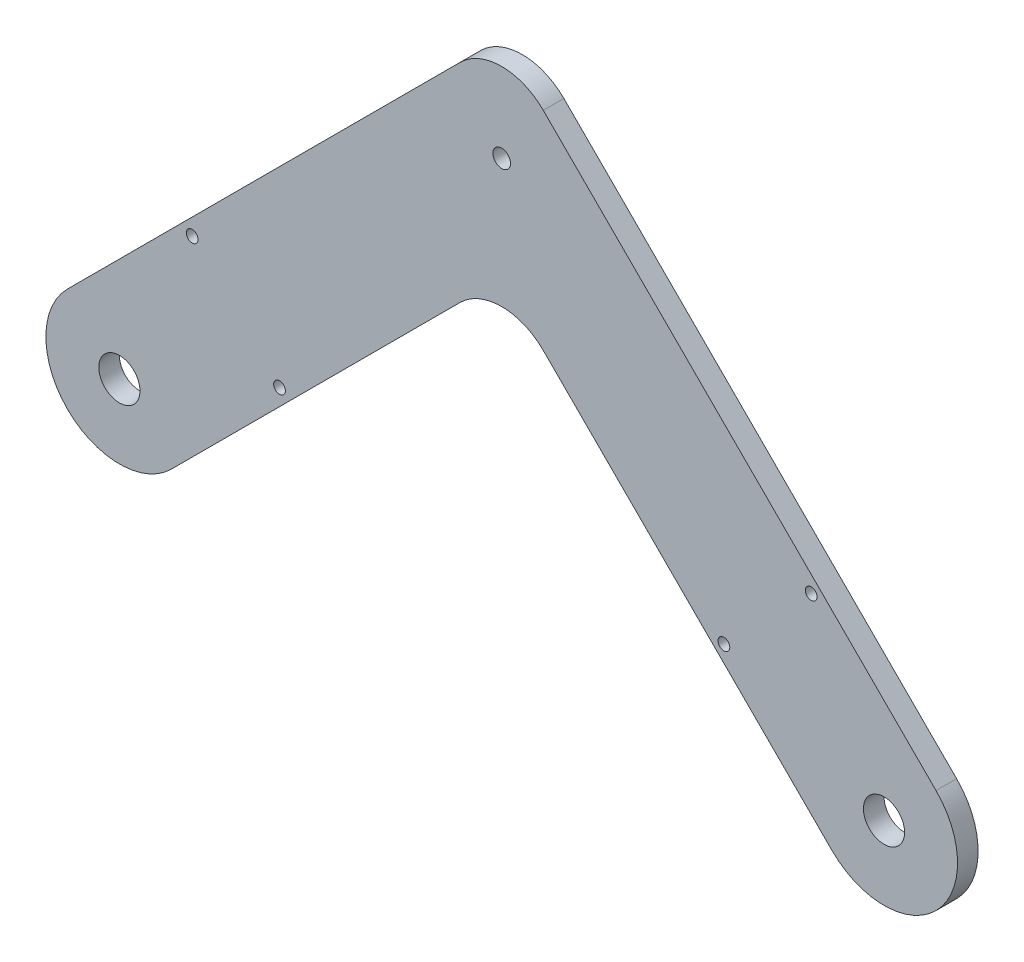
ISO-10303-21;
HEADER;
FILE_DESCRIPTION(('STEP AP214'),'2;1');
FILE_NAME('part.step','',(''),(''),'','','');
FILE_SCHEMA(('AUTOMOTIVE_DESIGN { 1 0 10303 214 1 1 1 1 }'));
ENDSEC;
DATA;
#1=APPLICATION_CONTEXT('core data for automotive mechanical design processes');
#2=APPLICATION_PROTOCOL_DEFINITION('international standard','automotive_design',2000,#1);
#3=PRODUCT_CONTEXT('',#1,'mechanical');
#4=PRODUCT('Part','Part','',(#3));
#5=PRODUCT_RELATED_PRODUCT_CATEGORY('part','',(#4));
#6=PRODUCT_DEFINITION_FORMATION('','',#4);
#7=PRODUCT_DEFINITION_CONTEXT('part definition',#1,'design');
#8=PRODUCT_DEFINITION('design','',#6,#7);
#9=PRODUCT_DEFINITION_SHAPE('','',#8);
#10=(LENGTH_UNIT() NAMED_UNIT(*) SI_UNIT(.MILLI.,.METRE.));
#11=(NAMED_UNIT(*) PLANE_ANGLE_UNIT() SI_UNIT($,.RADIAN.));
#12=(NAMED_UNIT(*) SI_UNIT($,.STERADIAN.) SOLID_ANGLE_UNIT());
#13=UNCERTAINTY_MEASURE_WITH_UNIT(LENGTH_MEASURE(1.E-05),#10,'distance_accuracy_value','');
#14=(GEOMETRIC_REPRESENTATION_CONTEXT(3) GLOBAL_UNCERTAINTY_ASSIGNED_CONTEXT((#13)) GLOBAL_UNIT_ASSIGNED_CONTEXT((#10,
#11,#12)) REPRESENTATION_CONTEXT('',''));
#15=CARTESIAN_POINT('',(0.,0.,0.));
#16=DIRECTION('',(0.,0.,1.));
#17=DIRECTION('',(1.,0.,0.));
#18=AXIS2_PLACEMENT_3D('',#15,#16,#17);
#19=CARTESIAN_POINT('',(-41.3388347648319,41.3388347648318,-3.5));
#20=DIRECTION('',(0.707106781186548,-0.707106781186548,0.));
#21=DIRECTION('',(0.707106781186547,0.707106781186548,0.));
#22=AXIS2_PLACEMENT_3D('',#19,#20,#21);
#23=PLANE('',#22);
#24=DIRECTION('',(0.707106781186547,0.707106781186548,0.));
#25=VECTOR('',#24,1.);
#26=CARTESIAN_POINT('',(-41.3388347648319,41.3388347648318,0.));
#27=LINE('',#26,#25);
#28=CARTESIAN_POINT('',(-73.8388347648318,8.83883476483185,0.));
#29=VERTEX_POINT('',#28);
#30=CARTESIAN_POINT('',(-7.07106781186494,75.6066017177988,0.));
#31=VERTEX_POINT('',#30);
#32=EDGE_CURVE('E142',#29,#31,#27,.T.);
#33=ORIENTED_EDGE('',*,*,#32,.T.);
#34=DIRECTION('',(0.,0.,1.));
#35=VECTOR('',#34,1.);
#36=CARTESIAN_POINT('',(-7.07106781186494,75.6066017177988,-3.5));
#37=LINE('',#36,#35);
#38=CARTESIAN_POINT('',(-7.07106781186494,75.6066017177988,-3.5));
#39=VERTEX_POINT('',#38);
#40=EDGE_CURVE('E53',#31,#39,#37,.F.);
#41=ORIENTED_EDGE('',*,*,#40,.T.);
#42=DIRECTION('',(0.707106781186547,0.707106781186548,0.));
#43=VECTOR('',#42,1.);
#44=CARTESIAN_POINT('',(-41.3388347648319,41.3388347648318,-3.5));
#45=LINE('',#44,#43);
#46=CARTESIAN_POINT('',(-73.8388347648318,8.83883476483185,-3.5));
#47=VERTEX_POINT('',#46);
#48=EDGE_CURVE('E113',#47,#39,#45,.T.);
#49=ORIENTED_EDGE('',*,*,#48,.F.);
#50=DIRECTION('',(0.,0.,1.));
#51=VECTOR('',#50,1.);
#52=CARTESIAN_POINT('',(-73.8388347648318,8.83883476483185,-3.5));
#53=LINE('',#52,#51);
#54=EDGE_CURVE('E104',#47,#29,#53,.T.);
#55=ORIENTED_EDGE('',*,*,#54,.T.);
#56=EDGE_LOOP('',(#33,#41,#49,#55));
#57=FACE_BOUND('',#56,.T.);
#58=ADVANCED_FACE('F38',(#57),#23,.F.);
#59=CARTESIAN_POINT('',(41.3388347648324,41.3388347648321,-3.5));
#60=DIRECTION('',(-0.70710678118655,-0.707106781186545,0.));
#61=DIRECTION('',(0.707106781186545,-0.70710678118655,0.));
#62=AXIS2_PLACEMENT_3D('',#59,#60,#61);
#63=PLANE('',#62);
#64=DIRECTION('',(0.707106781186545,-0.70710678118655,0.));
#65=VECTOR('',#64,1.);
#66=CARTESIAN_POINT('',(41.3388347648324,41.3388347648321,-3.5));
#67=LINE('',#66,#65);
#68=CARTESIAN_POINT('',(7.07106781186602,75.6066017177988,-3.5));
#69=VERTEX_POINT('',#68);
#70=CARTESIAN_POINT('',(73.8388347648326,8.83883476483167,-3.5));
#71=VERTEX_POINT('',#70);
#72=EDGE_CURVE('E111',#69,#71,#67,.T.);
#73=ORIENTED_EDGE('',*,*,#72,.F.);
#74=DIRECTION('',(0.,0.,1.));
#75=VECTOR('',#74,1.);
#76=CARTESIAN_POINT('',(7.07106781186603,75.6066017177987,-3.5));
#77=LINE('',#76,#75);
#78=CARTESIAN_POINT('',(7.07106781186602,75.6066017177988,0.));
#79=VERTEX_POINT('',#78);
#80=EDGE_CURVE('E168',#69,#79,#77,.T.);
#81=ORIENTED_EDGE('',*,*,#80,.T.);
#82=DIRECTION('',(0.707106781186545,-0.70710678118655,0.));
#83=VECTOR('',#82,1.);
#84=CARTESIAN_POINT('',(41.3388347648324,41.3388347648321,0.));
#85=LINE('',#84,#83);
#86=CARTESIAN_POINT('',(73.8388347648326,8.83883476483167,0.));
#87=VERTEX_POINT('',#86);
#88=EDGE_CURVE('E153',#79,#87,#85,.T.);
#89=ORIENTED_EDGE('',*,*,#88,.T.);
#90=DIRECTION('',(0.,0.,1.));
#91=VECTOR('',#90,1.);
#92=CARTESIAN_POINT('',(73.8388347648326,8.83883476483167,-3.5));
#93=LINE('',#92,#91);
#94=EDGE_CURVE('E156',#71,#87,#93,.T.);
#95=ORIENTED_EDGE('',*,*,#94,.F.);
#96=EDGE_LOOP('',(#73,#81,#89,#95));
#97=FACE_BOUND('',#96,.T.);
#98=ADVANCED_FACE('F195',(#97),#63,.F.);
#99=CARTESIAN_POINT('',(65.0000000000005,-2.44140223043168E-13,-3.5));
#100=DIRECTION('',(0.,0.,1.));
#101=DIRECTION('',(1.,0.,0.));
#102=AXIS2_PLACEMENT_3D('',#99,#100,#101);
#103=CYLINDRICAL_SURFACE('',#102,12.5000000000002);
#104=CARTESIAN_POINT('',(65.0000000000005,-2.44140223043168E-13,0.));
#105=DIRECTION('',(0.,0.,1.));
#106=DIRECTION('',(1.,0.,0.));
#107=AXIS2_PLACEMENT_3D('',#104,#105,#106);
#108=CIRCLE('',#107,12.5000000000002);
#109=CARTESIAN_POINT('',(56.1611652351685,-8.83883476483222,0.));
#110=VERTEX_POINT('',#109);
#111=EDGE_CURVE('E150',#110,#87,#108,.T.);
#112=ORIENTED_EDGE('',*,*,#111,.F.);
#113=DIRECTION('',(0.,0.,1.));
#114=VECTOR('',#113,1.);
#115=CARTESIAN_POINT('',(56.1611652351685,-8.83883476483222,-3.5));
#116=LINE('',#115,#114);
#117=CARTESIAN_POINT('',(56.1611652351685,-8.83883476483222,-3.5));
#118=VERTEX_POINT('',#117);
#119=EDGE_CURVE('E160',#118,#110,#116,.T.);
#120=ORIENTED_EDGE('',*,*,#119,.F.);
#121=CARTESIAN_POINT('',(65.0000000000005,-2.44140223043168E-13,-3.5));
#122=DIRECTION('',(0.,0.,1.));
#123=DIRECTION('',(1.,0.,0.));
#124=AXIS2_PLACEMENT_3D('',#121,#122,#123);
#125=CIRCLE('',#124,12.5000000000002);
#126=EDGE_CURVE('E128',#118,#71,#125,.T.);
#127=ORIENTED_EDGE('',*,*,#126,.T.);
#128=ORIENTED_EDGE('',*,*,#94,.T.);
#129=EDGE_LOOP('',(#112,#120,#127,#128));
#130=FACE_BOUND('',#129,.T.);
#131=ADVANCED_FACE('F197',(#130),#103,.T.);
#132=CARTESIAN_POINT('',(23.6611652351684,23.6611652351682,-3.5));
#133=DIRECTION('',(-0.70710678118655,-0.707106781186545,0.));
#134=DIRECTION('',(0.707106781186545,-0.70710678118655,0.));
#135=AXIS2_PLACEMENT_3D('',#132,#133,#134);
#136=PLANE('',#135);
#137=DIRECTION('',(0.707106781186545,-0.70710678118655,0.));
#138=VECTOR('',#137,1.);
#139=CARTESIAN_POINT('',(23.6611652351684,23.6611652351682,0.));
#140=LINE('',#139,#138);
#141=CARTESIAN_POINT('',(7.07106781186568,40.251262658471,0.));
#142=VERTEX_POINT('',#141);
#143=EDGE_CURVE('E148',#142,#110,#140,.T.);
#144=ORIENTED_EDGE('',*,*,#143,.F.);
#145=DIRECTION('',(0.,0.,1.));
#146=VECTOR('',#145,1.);
#147=CARTESIAN_POINT('',(7.07106781186568,40.251262658471,-3.5));
#148=LINE('',#147,#146);
#149=CARTESIAN_POINT('',(7.07106781186568,40.251262658471,-3.5));
#150=VERTEX_POINT('',#149);
#151=EDGE_CURVE('E166',#142,#150,#148,.F.);
#152=ORIENTED_EDGE('',*,*,#151,.T.);
#153=DIRECTION('',(0.707106781186545,-0.70710678118655,0.));
#154=VECTOR('',#153,1.);
#155=CARTESIAN_POINT('',(23.6611652351684,23.6611652351682,-3.5));
#156=LINE('',#155,#154);
#157=EDGE_CURVE('E123',#150,#118,#156,.T.);
#158=ORIENTED_EDGE('',*,*,#157,.T.);
#159=ORIENTED_EDGE('',*,*,#119,.T.);
#160=EDGE_LOOP('',(#144,#152,#158,#159));
#161=FACE_BOUND('',#160,.T.);
#162=ADVANCED_FACE('F181',(#161),#136,.T.);
#163=CARTESIAN_POINT('',(-23.6611652351682,23.6611652351682,-3.5));
#164=DIRECTION('',(0.707106781186547,-0.707106781186547,0.));
#165=DIRECTION('',(0.707106781186548,0.707106781186548,0.));
#166=AXIS2_PLACEMENT_3D('',#163,#164,#165);
#167=PLANE('',#166);
#168=DIRECTION('',(0.707106781186548,0.707106781186548,0.));
#169=VECTOR('',#168,1.);
#170=CARTESIAN_POINT('',(-23.6611652351682,23.6611652351682,-3.5));
#171=LINE('',#170,#169);
#172=CARTESIAN_POINT('',(-56.1611652351682,-8.83883476483185,-3.5));
#173=VERTEX_POINT('',#172);
#174=CARTESIAN_POINT('',(-7.07106781186529,40.251262658471,-3.5));
#175=VERTEX_POINT('',#174);
#176=EDGE_CURVE('E121',#173,#175,#171,.T.);
#177=ORIENTED_EDGE('',*,*,#176,.T.);
#178=DIRECTION('',(0.,0.,1.));
#179=VECTOR('',#178,1.);
#180=CARTESIAN_POINT('',(-7.07106781186529,40.251262658471,0.));
#181=LINE('',#180,#179);
#182=CARTESIAN_POINT('',(-7.07106781186529,40.251262658471,0.));
#183=VERTEX_POINT('',#182);
#184=EDGE_CURVE('E159',#175,#183,#181,.T.);
#185=ORIENTED_EDGE('',*,*,#184,.T.);
#186=DIRECTION('',(0.707106781186548,0.707106781186548,0.));
#187=VECTOR('',#186,1.);
#188=CARTESIAN_POINT('',(-23.6611652351682,23.6611652351682,0.));
#189=LINE('',#188,#187);
#190=CARTESIAN_POINT('',(-56.1611652351682,-8.83883476483185,0.));
#191=VERTEX_POINT('',#190);
#192=EDGE_CURVE('E145',#191,#183,#189,.T.);
#193=ORIENTED_EDGE('',*,*,#192,.F.);
#194=DIRECTION('',(0.,0.,1.));
#195=VECTOR('',#194,1.);
#196=CARTESIAN_POINT('',(-56.1611652351682,-8.83883476483185,-3.5));
#197=LINE('',#196,#195);
#198=EDGE_CURVE('E110',#173,#191,#197,.T.);
#199=ORIENTED_EDGE('',*,*,#198,.F.);
#200=EDGE_LOOP('',(#177,#185,#193,#199));
#201=FACE_BOUND('',#200,.T.);
#202=ADVANCED_FACE('F189',(#201),#167,.T.);
#203=CARTESIAN_POINT('',(65.,0.,-3.5));
#204=DIRECTION('',(0.,0.,1.));
#205=DIRECTION('',(1.,0.,0.));
#206=AXIS2_PLACEMENT_3D('',#203,#204,#205);
#207=CYLINDRICAL_SURFACE('',#206,3.50000000000001);
#208=CARTESIAN_POINT('',(65.,0.,-3.5));
#209=DIRECTION('',(0.,0.,1.));
#210=DIRECTION('',(1.,0.,0.));
#211=AXIS2_PLACEMENT_3D('',#208,#209,#210);
#212=CIRCLE('',#211,3.50000000000001);
#213=CARTESIAN_POINT('',(68.5,0.,-3.5));
#214=VERTEX_POINT('',#213);
#215=EDGE_CURVE('E116',#214,#214,#212,.T.);
#216=ORIENTED_EDGE('',*,*,#215,.F.);
#217=EDGE_LOOP('',(#216));
#218=FACE_BOUND('',#217,.T.);
#219=CARTESIAN_POINT('',(65.,0.,0.));
#220=DIRECTION('',(0.,0.,1.));
#221=DIRECTION('',(1.,0.,0.));
#222=AXIS2_PLACEMENT_3D('',#219,#220,#221);
#223=CIRCLE('',#222,3.50000000000001);
#224=CARTESIAN_POINT('',(68.5,0.,0.));
#225=VERTEX_POINT('',#224);
#226=EDGE_CURVE('E139',#225,#225,#223,.T.);
#227=ORIENTED_EDGE('',*,*,#226,.T.);
#228=EDGE_LOOP('',(#227));
#229=FACE_BOUND('',#228,.T.);
#230=ADVANCED_FACE('F213',(#218,#229),#207,.F.);
#231=CARTESIAN_POINT('',(-65.,0.,-3.5));
#232=DIRECTION('',(0.,0.,1.));
#233=DIRECTION('',(1.,0.,0.));
#234=AXIS2_PLACEMENT_3D('',#231,#232,#233);
#235=CYLINDRICAL_SURFACE('',#234,3.5);
#236=CARTESIAN_POINT('',(-65.,0.,-3.5));
#237=DIRECTION('',(0.,0.,1.));
#238=DIRECTION('',(1.,0.,0.));
#239=AXIS2_PLACEMENT_3D('',#236,#237,#238);
#240=CIRCLE('',#239,3.5);
#241=CARTESIAN_POINT('',(-61.5,0.,-3.5));
#242=VERTEX_POINT('',#241);
#243=EDGE_CURVE('E270',#242,#242,#240,.T.);
#244=ORIENTED_EDGE('',*,*,#243,.F.);
#245=EDGE_LOOP('',(#244));
#246=FACE_BOUND('',#245,.T.);
#247=CARTESIAN_POINT('',(-65.,0.,0.));
#248=DIRECTION('',(0.,0.,1.));
#249=DIRECTION('',(1.,0.,0.));
#250=AXIS2_PLACEMENT_3D('',#247,#248,#249);
#251=CIRCLE('',#250,3.5);
#252=CARTESIAN_POINT('',(-61.5,0.,0.));
#253=VERTEX_POINT('',#252);
#254=EDGE_CURVE('E135',#253,#253,#251,.T.);
#255=ORIENTED_EDGE('',*,*,#254,.T.);
#256=EDGE_LOOP('',(#255));
#257=FACE_BOUND('',#256,.T.);
#258=ADVANCED_FACE('F216',(#246,#257),#235,.F.);
#259=CARTESIAN_POINT('',(2.51969836731242E-13,65.0000000000002,-3.5));
#260=DIRECTION('',(0.,0.,1.));
#261=DIRECTION('',(1.,0.,0.));
#262=AXIS2_PLACEMENT_3D('',#259,#260,#261);
#263=CYLINDRICAL_SURFACE('',#262,1.5);
#264=CARTESIAN_POINT('',(2.51969836731242E-13,65.0000000000002,-3.5));
#265=DIRECTION('',(0.,0.,1.));
#266=DIRECTION('',(1.,0.,0.));
#267=AXIS2_PLACEMENT_3D('',#264,#265,#266);
#268=CIRCLE('',#267,1.5);
#269=CARTESIAN_POINT('',(1.50000000000025,65.0000000000002,-3.5));
#270=VERTEX_POINT('',#269);
#271=EDGE_CURVE('E155',#270,#270,#268,.T.);
#272=ORIENTED_EDGE('',*,*,#271,.F.);
#273=EDGE_LOOP('',(#272));
#274=FACE_BOUND('',#273,.T.);
#275=CARTESIAN_POINT('',(2.51969836731242E-13,65.0000000000002,0.));
#276=DIRECTION('',(0.,0.,1.));
#277=DIRECTION('',(1.,0.,0.));
#278=AXIS2_PLACEMENT_3D('',#275,#276,#277);
#279=CIRCLE('',#278,1.5);
#280=CARTESIAN_POINT('',(1.50000000000025,65.0000000000002,0.));
#281=VERTEX_POINT('',#280);
#282=EDGE_CURVE('E132',#281,#281,#279,.T.);
#283=ORIENTED_EDGE('',*,*,#282,.T.);
#284=EDGE_LOOP('',(#283));
#285=FACE_BOUND('',#284,.T.);
#286=ADVANCED_FACE('F220',(#274,#285),#263,.F.);
#287=CARTESIAN_POINT('',(-65.,0.,-3.5));
#288=DIRECTION('',(0.,0.,1.));
#289=DIRECTION('',(1.,0.,0.));
#290=AXIS2_PLACEMENT_3D('',#287,#288,#289);
#291=CYLINDRICAL_SURFACE('',#290,12.5);
#292=CARTESIAN_POINT('',(-65.,0.,0.));
#293=DIRECTION('',(0.,0.,1.));
#294=DIRECTION('',(1.,0.,0.));
#295=AXIS2_PLACEMENT_3D('',#292,#293,#294);
#296=CIRCLE('',#295,12.5);
#297=EDGE_CURVE('E109',#29,#191,#296,.T.);
#298=ORIENTED_EDGE('',*,*,#297,.F.);
#299=ORIENTED_EDGE('',*,*,#54,.F.);
#300=CARTESIAN_POINT('',(-65.,0.,-3.5));
#301=DIRECTION('',(0.,0.,1.));
#302=DIRECTION('',(1.,0.,0.));
#303=AXIS2_PLACEMENT_3D('',#300,#301,#302);
#304=CIRCLE('',#303,12.5);
#305=EDGE_CURVE('E107',#47,#173,#304,.T.);
#306=ORIENTED_EDGE('',*,*,#305,.T.);
#307=ORIENTED_EDGE('',*,*,#198,.T.);
#308=EDGE_LOOP('',(#298,#299,#306,#307));
#309=FACE_BOUND('',#308,.T.);
#310=ADVANCED_FACE('F105',(#309),#291,.T.);
#311=CARTESIAN_POINT('',(0.,0.,-3.5));
#312=DIRECTION('',(0.,0.,1.));
#313=DIRECTION('',(1.,0.,0.));
#314=AXIS2_PLACEMENT_3D('',#311,#312,#313);
#315=PLANE('',#314);
#316=CARTESIAN_POINT('',(-52.6256313292354,27.2236110756821,-3.5));
#317=DIRECTION('',(0.,0.,1.));
#318=DIRECTION('',(1.,0.,0.));
#319=AXIS2_PLACEMENT_3D('',#316,#317,#318);
#320=CIRCLE('',#319,0.999999999999998);
#321=CARTESIAN_POINT('',(-51.6256313292354,27.2236110756821,-3.5));
#322=VERTEX_POINT('',#321);
#323=EDGE_CURVE('E136',#322,#322,#320,.T.);
#324=ORIENTED_EDGE('',*,*,#323,.T.);
#325=EDGE_LOOP('',(#324));
#326=FACE_BOUND('',#325,.T.);
#327=CARTESIAN_POINT('',(-37.7763889243179,12.3743686707646,-3.5));
#328=DIRECTION('',(0.,0.,1.));
#329=DIRECTION('',(1.,0.,0.));
#330=AXIS2_PLACEMENT_3D('',#327,#328,#329);
#331=CIRCLE('',#330,0.999999999999997);
#332=CARTESIAN_POINT('',(-36.7763889243179,12.3743686707646,-3.5));
#333=VERTEX_POINT('',#332);
#334=EDGE_CURVE('E261',#333,#333,#331,.T.);
#335=ORIENTED_EDGE('',*,*,#334,.T.);
#336=EDGE_LOOP('',(#335));
#337=FACE_BOUND('',#336,.T.);
#338=CARTESIAN_POINT('',(37.7763889243179,12.3743686707646,-3.5));
#339=DIRECTION('',(0.,0.,1.));
#340=DIRECTION('',(1.,0.,0.));
#341=AXIS2_PLACEMENT_3D('',#338,#339,#340);
#342=CIRCLE('',#341,0.999999999999997);
#343=CARTESIAN_POINT('',(38.7763889243179,12.3743686707646,-3.5));
#344=VERTEX_POINT('',#343);
#345=EDGE_CURVE('E264',#344,#344,#342,.T.);
#346=ORIENTED_EDGE('',*,*,#345,.T.);
#347=EDGE_LOOP('',(#346));
#348=FACE_BOUND('',#347,.T.);
#349=CARTESIAN_POINT('',(52.6256313292354,27.2236110756821,-3.5));
#350=DIRECTION('',(0.,0.,1.));
#351=DIRECTION('',(1.,0.,0.));
#352=AXIS2_PLACEMENT_3D('',#349,#350,#351);
#353=CIRCLE('',#352,0.999999999999998);
#354=CARTESIAN_POINT('',(53.6256313292354,27.2236110756821,-3.5));
#355=VERTEX_POINT('',#354);
#356=EDGE_CURVE('E290',#355,#355,#353,.T.);
#357=ORIENTED_EDGE('',*,*,#356,.T.);
#358=EDGE_LOOP('',(#357));
#359=FACE_BOUND('',#358,.T.);
#360=ORIENTED_EDGE('',*,*,#271,.T.);
#361=EDGE_LOOP('',(#360));
#362=FACE_BOUND('',#361,.T.);
#363=ORIENTED_EDGE('',*,*,#243,.T.);
#364=EDGE_LOOP('',(#363));
#365=FACE_BOUND('',#364,.T.);
#366=ORIENTED_EDGE('',*,*,#215,.T.);
#367=EDGE_LOOP('',(#366));
#368=FACE_BOUND('',#367,.T.);
#369=ORIENTED_EDGE('',*,*,#48,.T.);
#370=CARTESIAN_POINT('',(5.34294830600857E-13,68.5355339059333,-3.5));
#371=DIRECTION('',(0.,0.,1.));
#372=DIRECTION('',(1.,0.,0.));
#373=AXIS2_PLACEMENT_3D('',#370,#371,#372);
#374=CIRCLE('',#373,10.);
#375=EDGE_CURVE('E173',#39,#69,#374,.F.);
#376=ORIENTED_EDGE('',*,*,#375,.T.);
#377=ORIENTED_EDGE('',*,*,#72,.T.);
#378=ORIENTED_EDGE('',*,*,#126,.F.);
#379=ORIENTED_EDGE('',*,*,#157,.F.);
#380=CARTESIAN_POINT('',(1.80411241501588E-13,33.1801948466055,-3.5));
#381=DIRECTION('',(0.,0.,1.));
#382=DIRECTION('',(1.,0.,0.));
#383=AXIS2_PLACEMENT_3D('',#380,#381,#382);
#384=CIRCLE('',#383,10.);
#385=EDGE_CURVE('E11',#150,#175,#384,.T.);
#386=ORIENTED_EDGE('',*,*,#385,.T.);
#387=ORIENTED_EDGE('',*,*,#176,.F.);
#388=ORIENTED_EDGE('',*,*,#305,.F.);
#389=EDGE_LOOP('',(#369,#376,#377,#378,#379,#386,#387,#388));
#390=FACE_BOUND('',#389,.T.);
#391=ADVANCED_FACE('F119',(#326,#337,#348,#359,#362,#365,#368,#390),#315,.F.);
#392=CARTESIAN_POINT('',(0.,0.,0.));
#393=DIRECTION('',(0.,0.,1.));
#394=DIRECTION('',(1.,0.,0.));
#395=AXIS2_PLACEMENT_3D('',#392,#393,#394);
#396=PLANE('',#395);
#397=CARTESIAN_POINT('',(-52.6256313292354,27.2236110756821,0.));
#398=DIRECTION('',(0.,0.,1.));
#399=DIRECTION('',(1.,0.,0.));
#400=AXIS2_PLACEMENT_3D('',#397,#398,#399);
#401=CIRCLE('',#400,0.999999999999998);
#402=CARTESIAN_POINT('',(-51.6256313292354,27.2236110756821,0.));
#403=VERTEX_POINT('',#402);
#404=EDGE_CURVE('E258',#403,#403,#401,.T.);
#405=ORIENTED_EDGE('',*,*,#404,.F.);
#406=EDGE_LOOP('',(#405));
#407=FACE_BOUND('',#406,.T.);
#408=CARTESIAN_POINT('',(-37.7763889243179,12.3743686707646,0.));
#409=DIRECTION('',(0.,0.,1.));
#410=DIRECTION('',(-1.,0.,0.));
#411=AXIS2_PLACEMENT_3D('',#408,#409,#410);
#412=CIRCLE('',#411,0.999999999999997);
#413=CARTESIAN_POINT('',(-38.7763889243179,12.3743686707646,0.));
#414=VERTEX_POINT('',#413);
#415=EDGE_CURVE('E299',#414,#414,#412,.T.);
#416=ORIENTED_EDGE('',*,*,#415,.F.);
#417=EDGE_LOOP('',(#416));
#418=FACE_BOUND('',#417,.T.);
#419=CARTESIAN_POINT('',(37.7763889243179,12.3743686707646,0.));
#420=DIRECTION('',(0.,0.,1.));
#421=DIRECTION('',(1.,0.,0.));
#422=AXIS2_PLACEMENT_3D('',#419,#420,#421);
#423=CIRCLE('',#422,0.999999999999997);
#424=CARTESIAN_POINT('',(38.7763889243179,12.3743686707646,0.));
#425=VERTEX_POINT('',#424);
#426=EDGE_CURVE('E296',#425,#425,#423,.T.);
#427=ORIENTED_EDGE('',*,*,#426,.F.);
#428=EDGE_LOOP('',(#427));
#429=FACE_BOUND('',#428,.T.);
#430=CARTESIAN_POINT('',(52.6256313292354,27.2236110756821,0.));
#431=DIRECTION('',(0.,0.,1.));
#432=DIRECTION('',(-1.,0.,0.));
#433=AXIS2_PLACEMENT_3D('',#430,#431,#432);
#434=CIRCLE('',#433,0.999999999999998);
#435=CARTESIAN_POINT('',(51.6256313292354,27.2236110756821,0.));
#436=VERTEX_POINT('',#435);
#437=EDGE_CURVE('E293',#436,#436,#434,.T.);
#438=ORIENTED_EDGE('',*,*,#437,.F.);
#439=EDGE_LOOP('',(#438));
#440=FACE_BOUND('',#439,.T.);
#441=ORIENTED_EDGE('',*,*,#282,.F.);
#442=EDGE_LOOP('',(#441));
#443=FACE_BOUND('',#442,.T.);
#444=ORIENTED_EDGE('',*,*,#254,.F.);
#445=EDGE_LOOP('',(#444));
#446=FACE_BOUND('',#445,.T.);
#447=ORIENTED_EDGE('',*,*,#226,.F.);
#448=EDGE_LOOP('',(#447));
#449=FACE_BOUND('',#448,.T.);
#450=ORIENTED_EDGE('',*,*,#88,.F.);
#451=CARTESIAN_POINT('',(5.34294830600857E-13,68.5355339059333,0.));
#452=DIRECTION('',(0.,0.,1.));
#453=DIRECTION('',(1.,0.,0.));
#454=AXIS2_PLACEMENT_3D('',#451,#452,#453);
#455=CIRCLE('',#454,10.);
#456=EDGE_CURVE('E61',#79,#31,#455,.T.);
#457=ORIENTED_EDGE('',*,*,#456,.T.);
#458=ORIENTED_EDGE('',*,*,#32,.F.);
#459=ORIENTED_EDGE('',*,*,#297,.T.);
#460=ORIENTED_EDGE('',*,*,#192,.T.);
#461=CARTESIAN_POINT('',(1.80411241501588E-13,33.1801948466055,0.));
#462=DIRECTION('',(0.,0.,1.));
#463=DIRECTION('',(1.,0.,0.));
#464=AXIS2_PLACEMENT_3D('',#461,#462,#463);
#465=CIRCLE('',#464,10.);
#466=EDGE_CURVE('E46',#183,#142,#465,.F.);
#467=ORIENTED_EDGE('',*,*,#466,.T.);
#468=ORIENTED_EDGE('',*,*,#143,.T.);
#469=ORIENTED_EDGE('',*,*,#111,.T.);
#470=EDGE_LOOP('',(#450,#457,#458,#459,#460,#467,#468,#469));
#471=FACE_BOUND('',#470,.T.);
#472=ADVANCED_FACE('F175',(#407,#418,#429,#440,#443,#446,#449,#471),#396,.T.);
#473=CARTESIAN_POINT('',(1.80411241501588E-13,33.1801948466055,-3.5));
#474=DIRECTION('',(0.,0.,-1.));
#475=DIRECTION('',(-1.,0.,0.));
#476=AXIS2_PLACEMENT_3D('',#473,#474,#475);
#477=CYLINDRICAL_SURFACE('',#476,10.);
#478=ORIENTED_EDGE('',*,*,#385,.F.);
#479=ORIENTED_EDGE('',*,*,#151,.F.);
#480=ORIENTED_EDGE('',*,*,#466,.F.);
#481=ORIENTED_EDGE('',*,*,#184,.F.);
#482=EDGE_LOOP('',(#478,#479,#480,#481));
#483=FACE_BOUND('',#482,.T.);
#484=ADVANCED_FACE('F186',(#483),#477,.F.);
#485=CARTESIAN_POINT('',(5.34294830600857E-13,68.5355339059333,-3.5));
#486=DIRECTION('',(0.,0.,1.));
#487=DIRECTION('',(1.,0.,0.));
#488=AXIS2_PLACEMENT_3D('',#485,#486,#487);
#489=CYLINDRICAL_SURFACE('',#488,10.);
#490=ORIENTED_EDGE('',*,*,#375,.F.);
#491=ORIENTED_EDGE('',*,*,#40,.F.);
#492=ORIENTED_EDGE('',*,*,#456,.F.);
#493=ORIENTED_EDGE('',*,*,#80,.F.);
#494=EDGE_LOOP('',(#490,#491,#492,#493));
#495=FACE_BOUND('',#494,.T.);
#496=ADVANCED_FACE('F40',(#495),#489,.T.);
#497=CARTESIAN_POINT('',(52.6256313292354,27.2236110756821,-10.));
#498=DIRECTION('',(0.,0.,1.));
#499=DIRECTION('',(1.,0.,0.));
#500=AXIS2_PLACEMENT_3D('',#497,#498,#499);
#501=CYLINDRICAL_SURFACE('',#500,0.999999999999998);
#502=ORIENTED_EDGE('',*,*,#437,.T.);
#503=EDGE_LOOP('',(#502));
#504=FACE_BOUND('',#503,.T.);
#505=ORIENTED_EDGE('',*,*,#356,.F.);
#506=EDGE_LOOP('',(#505));
#507=FACE_BOUND('',#506,.T.);
#508=ADVANCED_FACE('F229',(#504,#507),#501,.F.);
#509=CARTESIAN_POINT('',(37.7763889243179,12.3743686707646,-10.));
#510=DIRECTION('',(0.,0.,1.));
#511=DIRECTION('',(1.,0.,0.));
#512=AXIS2_PLACEMENT_3D('',#509,#510,#511);
#513=CYLINDRICAL_SURFACE('',#512,0.999999999999997);
#514=ORIENTED_EDGE('',*,*,#426,.T.);
#515=EDGE_LOOP('',(#514));
#516=FACE_BOUND('',#515,.T.);
#517=ORIENTED_EDGE('',*,*,#345,.F.);
#518=EDGE_LOOP('',(#517));
#519=FACE_BOUND('',#518,.T.);
#520=ADVANCED_FACE('F242',(#516,#519),#513,.F.);
#521=CARTESIAN_POINT('',(-37.7763889243179,12.3743686707646,-10.));
#522=DIRECTION('',(0.,0.,1.));
#523=DIRECTION('',(1.,0.,0.));
#524=AXIS2_PLACEMENT_3D('',#521,#522,#523);
#525=CYLINDRICAL_SURFACE('',#524,0.999999999999997);
#526=ORIENTED_EDGE('',*,*,#415,.T.);
#527=EDGE_LOOP('',(#526));
#528=FACE_BOUND('',#527,.T.);
#529=ORIENTED_EDGE('',*,*,#334,.F.);
#530=EDGE_LOOP('',(#529));
#531=FACE_BOUND('',#530,.T.);
#532=ADVANCED_FACE('F246',(#528,#531),#525,.F.);
#533=CARTESIAN_POINT('',(-52.6256313292354,27.2236110756821,-10.));
#534=DIRECTION('',(0.,0.,1.));
#535=DIRECTION('',(1.,0.,0.));
#536=AXIS2_PLACEMENT_3D('',#533,#534,#535);
#537=CYLINDRICAL_SURFACE('',#536,0.999999999999998);
#538=ORIENTED_EDGE('',*,*,#404,.T.);
#539=EDGE_LOOP('',(#538));
#540=FACE_BOUND('',#539,.T.);
#541=ORIENTED_EDGE('',*,*,#323,.F.);
#542=EDGE_LOOP('',(#541));
#543=FACE_BOUND('',#542,.T.);
#544=ADVANCED_FACE('F250',(#540,#543),#537,.F.);
#545=CLOSED_SHELL('',(#58,#98,#131,#162,#202,#230,#258,#286,#310,#391,#472,#484,#496,#508,#520,
#532,#544));
#546=MANIFOLD_SOLID_BREP('B2',#545);
#547=ADVANCED_BREP_SHAPE_REPRESENTATION('',(#18,#546),#14);
#548=SHAPE_DEFINITION_REPRESENTATION(#9,#547);
ENDSEC;
END-ISO-10303-21;
